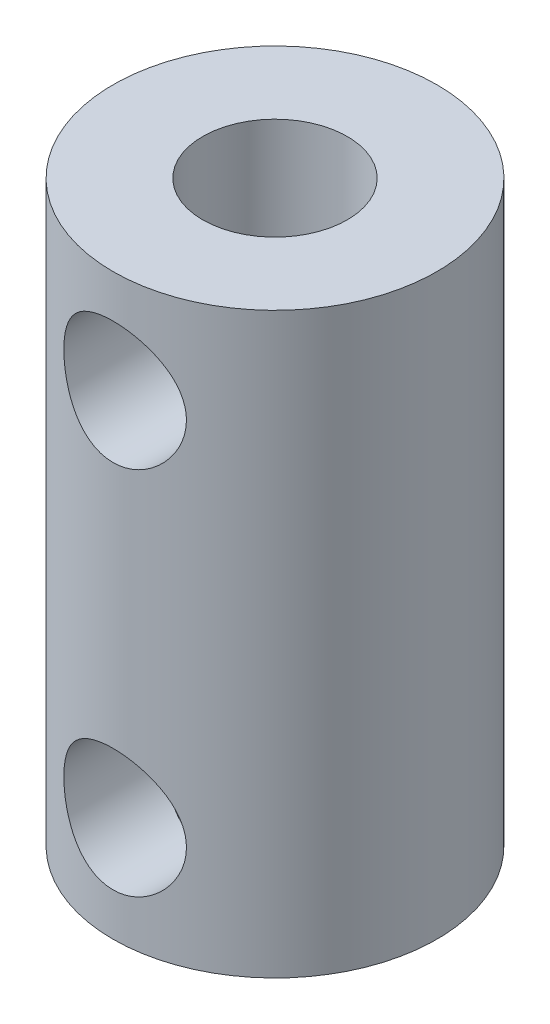
ISO-10303-21;
HEADER;
FILE_DESCRIPTION(('STEP AP214'),'2;1');
FILE_NAME('part.step','',(''),(''),'','','');
FILE_SCHEMA(('AUTOMOTIVE_DESIGN { 1 0 10303 214 1 1 1 1 }'));
ENDSEC;
DATA;
#1=APPLICATION_CONTEXT('core data for automotive mechanical design processes');
#2=APPLICATION_PROTOCOL_DEFINITION('international standard','automotive_design',2000,#1);
#3=PRODUCT_CONTEXT('',#1,'mechanical');
#4=PRODUCT('Part','Part','',(#3));
#5=PRODUCT_RELATED_PRODUCT_CATEGORY('part','',(#4));
#6=PRODUCT_DEFINITION_FORMATION('','',#4);
#7=PRODUCT_DEFINITION_CONTEXT('part definition',#1,'design');
#8=PRODUCT_DEFINITION('design','',#6,#7);
#9=PRODUCT_DEFINITION_SHAPE('','',#8);
#10=(LENGTH_UNIT() NAMED_UNIT(*) SI_UNIT(.MILLI.,.METRE.));
#11=(NAMED_UNIT(*) PLANE_ANGLE_UNIT() SI_UNIT($,.RADIAN.));
#12=(NAMED_UNIT(*) SI_UNIT($,.STERADIAN.) SOLID_ANGLE_UNIT());
#13=UNCERTAINTY_MEASURE_WITH_UNIT(LENGTH_MEASURE(1.E-05),#10,'distance_accuracy_value','');
#14=(GEOMETRIC_REPRESENTATION_CONTEXT(3) GLOBAL_UNCERTAINTY_ASSIGNED_CONTEXT((#13)) GLOBAL_UNIT_ASSIGNED_CONTEXT((#10,
#11,#12)) REPRESENTATION_CONTEXT('',''));
#15=CARTESIAN_POINT('',(0.,0.,0.));
#16=DIRECTION('',(0.,0.,1.));
#17=DIRECTION('',(1.,0.,0.));
#18=AXIS2_PLACEMENT_3D('',#15,#16,#17);
#19=CARTESIAN_POINT('',(0.,19.05,0.));
#20=DIRECTION('',(0.,-1.,0.));
#21=DIRECTION('',(0.,0.,-1.));
#22=AXIS2_PLACEMENT_3D('',#19,#20,#21);
#23=CYLINDRICAL_SURFACE('',#22,5.334);
#24=CARTESIAN_POINT('',(2.0193,15.621,4.93700146951568));
#25=CARTESIAN_POINT('',(2.01930447944565,15.5120335579433,4.93699724405045));
#26=CARTESIAN_POINT('',(2.01045059439057,15.4030962944664,4.94064814854933));
#27=CARTESIAN_POINT('',(1.97543444054489,15.1885111713563,4.95475201963925));
#28=CARTESIAN_POINT('',(1.94927294682313,15.0828631646455,4.96520468163384));
#29=CARTESIAN_POINT('',(1.88074304619809,14.8780172165251,4.99156194094386));
#30=CARTESIAN_POINT('',(1.83841414033232,14.7788042384707,5.00745324054417));
#31=CARTESIAN_POINT('',(1.73889128334472,14.5888489765568,5.04287560500619));
#32=CARTESIAN_POINT('',(1.68169277752621,14.4981092997438,5.06240778458365));
#33=CARTESIAN_POINT('',(1.55095007886271,14.3230779704603,5.1040199433203));
#34=CARTESIAN_POINT('',(1.47677408325426,14.2392761792463,5.12617585427608));
#35=CARTESIAN_POINT('',(1.31552180232293,14.0849552129414,5.16990629793248));
#36=CARTESIAN_POINT('',(1.22844270450761,14.0144389413296,5.19148070266726));
#37=CARTESIAN_POINT('',(1.04012523794396,13.8863181623324,5.23252204526852));
#38=CARTESIAN_POINT('',(0.938499803257831,13.8292478975599,5.25188961400418));
#39=CARTESIAN_POINT('',(0.726227423158128,13.7332177255443,5.28542063488425));
#40=CARTESIAN_POINT('',(0.615583687488664,13.694251407642,5.29958592879611));
#41=CARTESIAN_POINT('',(0.393566749542695,13.637258622755,5.32057718322423));
#42=CARTESIAN_POINT('',(0.282438553669897,13.6183884135688,5.32769789450094));
#43=CARTESIAN_POINT('',(0.0583798398278738,13.5994181530748,5.33485652895422));
#44=CARTESIAN_POINT('',(-0.0545500684528991,13.5993118814679,5.33489679931724));
#45=CARTESIAN_POINT('',(-0.272951762873949,13.6173851886313,5.32807636219454));
#46=CARTESIAN_POINT('',(-0.378512558081566,13.6346433362102,5.32156339727964));
#47=CARTESIAN_POINT('',(-0.585111251091155,13.6854031817999,5.30282614548131));
#48=CARTESIAN_POINT('',(-0.686148827388549,13.7189060324673,5.29060145331974));
#49=CARTESIAN_POINT('',(-0.882591199788241,13.8016228590768,5.26142589156488));
#50=CARTESIAN_POINT('',(-0.977891853376851,13.8510597051342,5.24440843901689));
#51=CARTESIAN_POINT('',(-1.15908281530853,13.964042392838,5.20736477295068));
#52=CARTESIAN_POINT('',(-1.24497004337342,14.027592832296,5.18733757963256));
#53=CARTESIAN_POINT('',(-1.41031734945089,14.1714187169088,5.14492730665769));
#54=CARTESIAN_POINT('',(-1.48909060289719,14.2524645063247,5.12247495361345));
#55=CARTESIAN_POINT('',(-1.6321897223364,14.426744223767,5.07869327063848));
#56=CARTESIAN_POINT('',(-1.69651181554814,14.5199813245657,5.05736423508365));
#57=CARTESIAN_POINT('',(-1.81023010786301,14.7187569660041,5.01780263958016));
#58=CARTESIAN_POINT('',(-1.85924901990288,14.8245291017029,4.99965257367589));
#59=CARTESIAN_POINT('',(-1.93851753880742,15.0436953907817,4.96945937974622));
#60=CARTESIAN_POINT('',(-1.96877783080307,15.1570851641898,4.95741277583277));
#61=CARTESIAN_POINT('',(-2.0080927254921,15.381470834286,4.94161372576153));
#62=CARTESIAN_POINT('',(-2.01824049485178,15.4922448827508,4.93743437273379));
#63=CARTESIAN_POINT('',(-2.02020093934924,15.7139676015321,4.93663342024542));
#64=CARTESIAN_POINT('',(-2.01201832383528,15.8249162196809,4.94000987958409));
#65=CARTESIAN_POINT('',(-1.97854205652087,16.0381681308523,4.95350589275915));
#66=CARTESIAN_POINT('',(-1.95410194104482,16.1406292160252,4.96328872527596));
#67=CARTESIAN_POINT('',(-1.88988298600506,16.3399465155951,4.98809328378994));
#68=CARTESIAN_POINT('',(-1.85010096750629,16.4368015636007,5.00311609548081));
#69=CARTESIAN_POINT('',(-1.75463072385413,16.626246264666,5.03740860205377));
#70=CARTESIAN_POINT('',(-1.69839621410486,16.7185346107973,5.05681781536739));
#71=CARTESIAN_POINT('',(-1.57219523321137,16.8927525289866,5.09746480725639));
#72=CARTESIAN_POINT('',(-1.50222365366067,16.9746782287931,5.11870326441882));
#73=CARTESIAN_POINT('',(-1.34516894631353,17.1313561978071,5.16227937258415));
#74=CARTESIAN_POINT('',(-1.25727058071109,17.2052991261111,5.18459902436317));
#75=CARTESIAN_POINT('',(-1.06976739053702,17.3374862714004,5.22650650196035));
#76=CARTESIAN_POINT('',(-0.970162473418259,17.3957303642651,5.24609430617898));
#77=CARTESIAN_POINT('',(-0.762084546055996,17.4945035084064,5.28032694944767));
#78=CARTESIAN_POINT('',(-0.653639678197282,17.5350863566806,5.29498676788628));
#79=CARTESIAN_POINT('',(-0.430779322695876,17.5971996745722,5.31775366325145));
#80=CARTESIAN_POINT('',(-0.316366729446476,17.6187392909675,5.32586388589443));
#81=CARTESIAN_POINT('',(-0.0921269840688149,17.6411543720754,5.33431446661301));
#82=CARTESIAN_POINT('',(0.0175700260696667,17.6431789284285,5.33508685186249));
#83=CARTESIAN_POINT('',(0.235675890355791,17.629473185899,5.32990684279753));
#84=CARTESIAN_POINT('',(0.344084903230242,17.6137450981927,5.32395528598201));
#85=CARTESIAN_POINT('',(0.553754325491232,17.5657898974954,5.3061959436016));
#86=CARTESIAN_POINT('',(0.65512610504446,17.5339892623025,5.29453976881732));
#87=CARTESIAN_POINT('',(0.851099804673822,17.455219495065,5.26659215506921));
#88=CARTESIAN_POINT('',(0.945700438435499,17.408247490209,5.2502998382871));
#89=CARTESIAN_POINT('',(1.12984126460487,17.2982057895377,5.21384686801513));
#90=CARTESIAN_POINT('',(1.21899691290268,17.234538077362,5.19355150342232));
#91=CARTESIAN_POINT('',(1.38571137675006,17.0938489191121,5.15157869080139));
#92=CARTESIAN_POINT('',(1.46326600313847,17.0168226708103,5.1299007475314));
#93=CARTESIAN_POINT('',(1.60889417238223,16.8466570416454,5.08616858438968));
#94=CARTESIAN_POINT('',(1.6762289849352,16.7528718973078,5.06415732477682));
#95=CARTESIAN_POINT('',(1.79422016325732,16.5546238470352,5.0235682226187));
#96=CARTESIAN_POINT('',(1.84487417660335,16.4501594377681,5.00499086450409));
#97=CARTESIAN_POINT('',(1.92989734602869,16.2276068736325,4.97285117373348));
#98=CARTESIAN_POINT('',(1.96328114135574,16.1090925540968,4.9596003647767));
#99=CARTESIAN_POINT('',(2.00797225124147,15.8673708442459,4.94168088836878));
#100=CARTESIAN_POINT('',(2.01929493679982,15.7441667825565,4.93700624563709));
#101=CARTESIAN_POINT('',(2.0193,15.621,4.93700146951568));
#102=B_SPLINE_CURVE_WITH_KNOTS('',3,(#24,#25,#26,#27,#28,#29,#30,#31,#32,#33,#34,#35,#36,#37,
#38,#39,#40,#41,#42,#43,#44,#45,#46,#47,#48,#49,#50,#51,#52,#53,#54,#55,#56,#57,#58,#59,#60,#61,
#62,#63,#64,#65,#66,#67,#68,#69,#70,#71,#72,#73,#74,#75,#76,#77,#78,#79,#80,#81,#82,#83,#84,#85,
#86,#87,#88,#89,#90,#91,#92,#93,#94,#95,#96,#97,#98,#99,#100,#101),.UNSPECIFIED.,.T.,.F.,(4,2,2,
2,2,2,2,2,2,2,2,2,2,2,2,2,2,2,2,2,2,2,2,2,2,2,2,2,2,2,2,2,2,2,2,2,2,2,4),(0.,0.326440462933106,
0.652866308208241,0.978499662966162,1.30423288001533,1.64497726295524,1.98579602758814,
2.33846601182069,2.6910110192498,3.02808777213958,3.3650527829088,3.68503301877185,
4.00503596242418,4.32972461584072,4.6545191992502,4.99864582720001,5.3428621925583,
5.69499486283585,6.04692676944591,6.37913973630185,6.71126736249903,7.02720512429606,
7.34320838551139,7.67120245546792,7.99931872846169,8.34870603281663,8.69809609946862,
9.04641432838323,9.39456516328482,9.72208120206037,10.0495564516543,10.3687657960399,
10.6880356205533,11.0208403418839,11.3537649513075,11.7046787209908,12.0556419573988,
12.4248810015917,12.7938626876671),.UNSPECIFIED.);
#103=CARTESIAN_POINT('',(2.0193,15.621,4.93700146951568));
#104=VERTEX_POINT('',#103);
#105=EDGE_CURVE('E107',#104,#104,#102,.T.);
#106=ORIENTED_EDGE('',*,*,#105,.T.);
#107=EDGE_LOOP('',(#106));
#108=FACE_BOUND('',#107,.T.);
#109=CARTESIAN_POINT('',(2.0193,3.429,4.93700146951568));
#110=CARTESIAN_POINT('',(2.01930447944565,3.32003355794329,4.93699724405045));
#111=CARTESIAN_POINT('',(2.01045059439057,3.21109629446639,4.94064814854933));
#112=CARTESIAN_POINT('',(1.97543444054489,2.99651117135628,4.95475201963925));
#113=CARTESIAN_POINT('',(1.94927294682313,2.89086316464548,4.96520468163384));
#114=CARTESIAN_POINT('',(1.88074304619809,2.68601721652511,4.99156194094386));
#115=CARTESIAN_POINT('',(1.83841414033232,2.5868042384707,5.00745324054417));
#116=CARTESIAN_POINT('',(1.73889128334472,2.39684897655679,5.04287560500619));
#117=CARTESIAN_POINT('',(1.68169277752621,2.30610929974384,5.06240778458365));
#118=CARTESIAN_POINT('',(1.55095007886271,2.1310779704603,5.1040199433203));
#119=CARTESIAN_POINT('',(1.47677408325426,2.04727617924628,5.12617585427608));
#120=CARTESIAN_POINT('',(1.31552180232293,1.89295521294143,5.16990629793248));
#121=CARTESIAN_POINT('',(1.22844270450761,1.8224389413296,5.19148070266726));
#122=CARTESIAN_POINT('',(1.04012523794396,1.69431816233236,5.23252204526852));
#123=CARTESIAN_POINT('',(0.938499803257831,1.63724789755994,5.25188961400418));
#124=CARTESIAN_POINT('',(0.726227423158128,1.54121772554432,5.28542063488425));
#125=CARTESIAN_POINT('',(0.615583687488665,1.50225140764203,5.29958592879611));
#126=CARTESIAN_POINT('',(0.393566749542695,1.44525862275502,5.32057718322423));
#127=CARTESIAN_POINT('',(0.282438553669898,1.42638841356883,5.32769789450094));
#128=CARTESIAN_POINT('',(0.0583798398278739,1.40741815307482,5.33485652895422));
#129=CARTESIAN_POINT('',(-0.0545500684528991,1.40731188146786,5.33489679931724));
#130=CARTESIAN_POINT('',(-0.272951762873949,1.42538518863126,5.32807636219454));
#131=CARTESIAN_POINT('',(-0.378512558081566,1.44264333621018,5.32156339727964));
#132=CARTESIAN_POINT('',(-0.585111251091156,1.49340318179991,5.30282614548131));
#133=CARTESIAN_POINT('',(-0.686148827388549,1.52690603246726,5.29060145331974));
#134=CARTESIAN_POINT('',(-0.882591199788242,1.60962285907683,5.26142589156488));
#135=CARTESIAN_POINT('',(-0.977891853376852,1.65905970513419,5.24440843901689));
#136=CARTESIAN_POINT('',(-1.15908281530853,1.77204239283796,5.20736477295068));
#137=CARTESIAN_POINT('',(-1.24497004337342,1.83559283229603,5.18733757963256));
#138=CARTESIAN_POINT('',(-1.41031734945089,1.97941871690877,5.14492730665769));
#139=CARTESIAN_POINT('',(-1.48909060289719,2.06046450632471,5.12247495361345));
#140=CARTESIAN_POINT('',(-1.6321897223364,2.23474422376699,5.07869327063848));
#141=CARTESIAN_POINT('',(-1.69651181554814,2.32798132456567,5.05736423508365));
#142=CARTESIAN_POINT('',(-1.81023010786301,2.52675696600407,5.01780263958016));
#143=CARTESIAN_POINT('',(-1.85924901990288,2.63252910170293,4.99965257367589));
#144=CARTESIAN_POINT('',(-1.93851753880742,2.85169539078174,4.96945937974622));
#145=CARTESIAN_POINT('',(-1.96877783080307,2.96508516418983,4.95741277583277));
#146=CARTESIAN_POINT('',(-2.0080927254921,3.18947083428604,4.94161372576153));
#147=CARTESIAN_POINT('',(-2.01824049485178,3.30024488275082,4.93743437273379));
#148=CARTESIAN_POINT('',(-2.02020093934924,3.52196760153214,4.93663342024542));
#149=CARTESIAN_POINT('',(-2.01201832383528,3.63291621968089,4.94000987958409));
#150=CARTESIAN_POINT('',(-1.97854205652087,3.84616813085234,4.95350589275915));
#151=CARTESIAN_POINT('',(-1.95410194104482,3.94862921602521,4.96328872527596));
#152=CARTESIAN_POINT('',(-1.88988298600506,4.14794651559512,4.98809328378994));
#153=CARTESIAN_POINT('',(-1.85010096750629,4.24480156360068,5.00311609548081));
#154=CARTESIAN_POINT('',(-1.75463072385413,4.43424626466602,5.03740860205377));
#155=CARTESIAN_POINT('',(-1.69839621410486,4.5265346107973,5.05681781536739));
#156=CARTESIAN_POINT('',(-1.57219523321137,4.70075252898663,5.09746480725639));
#157=CARTESIAN_POINT('',(-1.50222365366067,4.78267822879312,5.11870326441882));
#158=CARTESIAN_POINT('',(-1.34516894631353,4.93935619780713,5.16227937258415));
#159=CARTESIAN_POINT('',(-1.25727058071109,5.01329912611112,5.18459902436317));
#160=CARTESIAN_POINT('',(-1.06976739053702,5.14548627140036,5.22650650196035));
#161=CARTESIAN_POINT('',(-0.970162473418259,5.20373036426514,5.24609430617898));
#162=CARTESIAN_POINT('',(-0.762084546055996,5.30250350840644,5.28032694944767));
#163=CARTESIAN_POINT('',(-0.653639678197282,5.34308635668056,5.29498676788628));
#164=CARTESIAN_POINT('',(-0.430779322695876,5.40519967457225,5.31775366325145));
#165=CARTESIAN_POINT('',(-0.316366729446475,5.42673929096748,5.32586388589443));
#166=CARTESIAN_POINT('',(-0.0921269840688147,5.44915437207543,5.33431446661301));
#167=CARTESIAN_POINT('',(0.0175700260696662,5.45117892842854,5.33508685186249));
#168=CARTESIAN_POINT('',(0.23567589035579,5.43747318589899,5.32990684279753));
#169=CARTESIAN_POINT('',(0.344084903230243,5.42174509819271,5.32395528598201));
#170=CARTESIAN_POINT('',(0.553754325491234,5.37378989749537,5.3061959436016));
#171=CARTESIAN_POINT('',(0.655126105044462,5.3419892623025,5.29453976881732));
#172=CARTESIAN_POINT('',(0.851099804673824,5.263219495065,5.26659215506921));
#173=CARTESIAN_POINT('',(0.945700438435501,5.21624749020903,5.2502998382871));
#174=CARTESIAN_POINT('',(1.12984126460487,5.1062057895377,5.21384686801513));
#175=CARTESIAN_POINT('',(1.21899691290268,5.04253807736199,5.19355150342232));
#176=CARTESIAN_POINT('',(1.38571137675006,4.90184891911211,5.15157869080139));
#177=CARTESIAN_POINT('',(1.46326600313847,4.82482267081035,5.1299007475314));
#178=CARTESIAN_POINT('',(1.60889417238223,4.65465704164544,5.08616858438968));
#179=CARTESIAN_POINT('',(1.6762289849352,4.5608718973078,5.06415732477682));
#180=CARTESIAN_POINT('',(1.79422016325732,4.36262384703517,5.0235682226187));
#181=CARTESIAN_POINT('',(1.84487417660335,4.25815943776813,5.00499086450409));
#182=CARTESIAN_POINT('',(1.92989734602869,4.03560687363247,4.97285117373348));
#183=CARTESIAN_POINT('',(1.96328114135574,3.91709255409683,4.9596003647767));
#184=CARTESIAN_POINT('',(2.00797225124147,3.67537084424586,4.94168088836878));
#185=CARTESIAN_POINT('',(2.01929493679982,3.55216678255649,4.93700624563709));
#186=CARTESIAN_POINT('',(2.0193,3.429,4.93700146951568));
#187=B_SPLINE_CURVE_WITH_KNOTS('',3,(#109,#110,#111,#112,#113,#114,#115,#116,#117,#118,#119,
#120,#121,#122,#123,#124,#125,#126,#127,#128,#129,#130,#131,#132,#133,#134,#135,#136,#137,#138,
#139,#140,#141,#142,#143,#144,#145,#146,#147,#148,#149,#150,#151,#152,#153,#154,#155,#156,#157,
#158,#159,#160,#161,#162,#163,#164,#165,#166,#167,#168,#169,#170,#171,#172,#173,#174,#175,#176,
#177,#178,#179,#180,#181,#182,#183,#184,#185,#186),.UNSPECIFIED.,.T.,.F.,(4,2,2,2,2,2,2,2,2,2,2,
2,2,2,2,2,2,2,2,2,2,2,2,2,2,2,2,2,2,2,2,2,2,2,2,2,2,2,4),(0.,0.326440462933105,
0.652866308208241,0.978499662966163,1.30423288001533,1.64497726295524,1.98579602758814,
2.33846601182069,2.6910110192498,3.02808777213957,3.3650527829088,3.68503301877185,
4.00503596242418,4.32972461584072,4.6545191992502,4.99864582720001,5.34286219255831,
5.69499486283585,6.04692676944592,6.37913973630185,6.71126736249903,7.02720512429606,
7.3432083855114,7.67120245546792,7.99931872846169,8.34870603281663,8.69809609946862,
9.04641432838323,9.39456516328482,9.72208120206037,10.0495564516543,10.3687657960399,
10.6880356205533,11.0208403418839,11.3537649513075,11.7046787209908,12.0556419573988,
12.4248810015917,12.7938626876671),.UNSPECIFIED.);
#188=CARTESIAN_POINT('',(2.0193,3.429,4.93700146951568));
#189=VERTEX_POINT('',#188);
#190=EDGE_CURVE('E56',#189,#189,#187,.T.);
#191=ORIENTED_EDGE('',*,*,#190,.T.);
#192=EDGE_LOOP('',(#191));
#193=FACE_BOUND('',#192,.T.);
#194=CARTESIAN_POINT('',(0.,19.05,0.));
#195=DIRECTION('',(0.,1.,0.));
#196=DIRECTION('',(0.,0.,1.));
#197=AXIS2_PLACEMENT_3D('',#194,#195,#196);
#198=CIRCLE('',#197,5.334);
#199=CARTESIAN_POINT('',(0.,19.05,5.334));
#200=VERTEX_POINT('',#199);
#201=EDGE_CURVE('E10',#200,#200,#198,.T.);
#202=ORIENTED_EDGE('',*,*,#201,.F.);
#203=EDGE_LOOP('',(#202));
#204=FACE_BOUND('',#203,.T.);
#205=CARTESIAN_POINT('',(0.,0.,0.));
#206=DIRECTION('',(0.,1.,0.));
#207=DIRECTION('',(0.,0.,1.));
#208=AXIS2_PLACEMENT_3D('',#205,#206,#207);
#209=CIRCLE('',#208,5.334);
#210=CARTESIAN_POINT('',(0.,0.,5.334));
#211=VERTEX_POINT('',#210);
#212=EDGE_CURVE('E41',#211,#211,#209,.T.);
#213=ORIENTED_EDGE('',*,*,#212,.T.);
#214=EDGE_LOOP('',(#213));
#215=FACE_BOUND('',#214,.T.);
#216=ADVANCED_FACE('F33',(#108,#193,#204,#215),#23,.T.);
#217=CARTESIAN_POINT('',(0.,19.05,0.));
#218=DIRECTION('',(0.,1.,0.));
#219=DIRECTION('',(0.,0.,1.));
#220=AXIS2_PLACEMENT_3D('',#217,#218,#219);
#221=PLANE('',#220);
#222=CARTESIAN_POINT('',(0.,19.05,0.));
#223=DIRECTION('',(0.,1.,0.));
#224=DIRECTION('',(0.,0.,1.));
#225=AXIS2_PLACEMENT_3D('',#222,#223,#224);
#226=CIRCLE('',#225,2.38125);
#227=CARTESIAN_POINT('',(0.,19.05,2.38125));
#228=VERTEX_POINT('',#227);
#229=EDGE_CURVE('E46',#228,#228,#226,.T.);
#230=ORIENTED_EDGE('',*,*,#229,.F.);
#231=EDGE_LOOP('',(#230));
#232=FACE_BOUND('',#231,.T.);
#233=ORIENTED_EDGE('',*,*,#201,.T.);
#234=EDGE_LOOP('',(#233));
#235=FACE_BOUND('',#234,.T.);
#236=ADVANCED_FACE('F91',(#232,#235),#221,.T.);
#237=CARTESIAN_POINT('',(0.,0.,0.));
#238=DIRECTION('',(0.,1.,0.));
#239=DIRECTION('',(0.,0.,1.));
#240=AXIS2_PLACEMENT_3D('',#237,#238,#239);
#241=PLANE('',#240);
#242=CARTESIAN_POINT('',(0.,0.,0.));
#243=DIRECTION('',(0.,-1.,0.));
#244=DIRECTION('',(0.,0.,-1.));
#245=AXIS2_PLACEMENT_3D('',#242,#243,#244);
#246=CIRCLE('',#245,2.5);
#247=CARTESIAN_POINT('',(0.,0.,-2.5));
#248=VERTEX_POINT('',#247);
#249=EDGE_CURVE('E53',#248,#248,#246,.T.);
#250=ORIENTED_EDGE('',*,*,#249,.F.);
#251=EDGE_LOOP('',(#250));
#252=FACE_BOUND('',#251,.T.);
#253=ORIENTED_EDGE('',*,*,#212,.F.);
#254=EDGE_LOOP('',(#253));
#255=FACE_BOUND('',#254,.T.);
#256=ADVANCED_FACE('F89',(#252,#255),#241,.F.);
#257=CARTESIAN_POINT('',(0.,19.05,0.));
#258=DIRECTION('',(0.,1.,0.));
#259=DIRECTION('',(0.,0.,1.));
#260=AXIS2_PLACEMENT_3D('',#257,#258,#259);
#261=CYLINDRICAL_SURFACE('',#260,2.38125);
#262=CARTESIAN_POINT('',(0.,13.6017,2.38125));
#263=CARTESIAN_POINT('',(0.0953629104655444,13.6017076270073,2.38124253039144));
#264=CARTESIAN_POINT('',(0.190802108760295,13.6085092245672,2.37546734710483));
#265=CARTESIAN_POINT('',(0.378522642630376,13.6352212283207,2.35288074385142));
#266=CARTESIAN_POINT('',(0.470799602849391,13.6551490824309,2.33605463466276));
#267=CARTESIAN_POINT('',(0.649001001306386,13.7066013327425,2.29292507231236));
#268=CARTESIAN_POINT('',(0.734961456500048,13.7380526583004,2.26668135756056));
#269=CARTESIAN_POINT('',(0.899589961526483,13.8109090763623,2.20653313778075));
#270=CARTESIAN_POINT('',(0.978256219196272,13.8523166061443,2.17262675705496));
#271=CARTESIAN_POINT('',(1.15557339189203,13.9606690983626,2.08520638110215));
#272=CARTESIAN_POINT('',(1.25065737001747,14.0313678422185,2.02910742735934));
#273=CARTESIAN_POINT('',(1.42522939866516,14.1857486420274,1.9105672437686));
#274=CARTESIAN_POINT('',(1.50467346358863,14.2694661624849,1.84810885556737));
#275=CARTESIAN_POINT('',(1.64933174400918,14.4501248906923,1.72031634910399));
#276=CARTESIAN_POINT('',(1.7142350405087,14.5472939776329,1.65494982419495));
#277=CARTESIAN_POINT('',(1.79900279926647,14.701981110901,1.56068668781034));
#278=CARTESIAN_POINT('',(1.82514764292368,14.7549941912649,1.52991595681427));
#279=CARTESIAN_POINT('',(1.87308341201357,14.8642374873892,1.47083283951932));
#280=CARTESIAN_POINT('',(1.8948779467709,14.9204649859904,1.44251842640646));
#281=CARTESIAN_POINT('',(1.93515484360135,15.0404584935458,1.38807520873408));
#282=CARTESIAN_POINT('',(1.95329720946325,15.1044766102372,1.3622394432428));
#283=CARTESIAN_POINT('',(1.98347250317504,15.236338473294,1.31791921961998));
#284=CARTESIAN_POINT('',(1.99551907391841,15.3041732957463,1.29941836563926));
#285=CARTESIAN_POINT('',(2.01275183491318,15.4438078770719,1.27257913004167));
#286=CARTESIAN_POINT('',(2.01784043973761,15.5156496128869,1.26438543090715));
#287=CARTESIAN_POINT('',(2.0202109452522,15.659784754737,1.26059917402889));
#288=CARTESIAN_POINT('',(2.0174974139974,15.7320778717616,1.26499924278155));
#289=CARTESIAN_POINT('',(2.00556583448943,15.8639689210915,1.28380009597221));
#290=CARTESIAN_POINT('',(1.99734029349534,15.9238963480108,1.29667017310109));
#291=CARTESIAN_POINT('',(1.97601922564263,16.0410864318142,1.32893840545107));
#292=CARTESIAN_POINT('',(1.96291624825171,16.0983448603164,1.34834654356129));
#293=CARTESIAN_POINT('',(1.91962562556337,16.2565468704425,1.40986433156581));
#294=CARTESIAN_POINT('',(1.88431652143136,16.3539536213483,1.45738069102626));
#295=CARTESIAN_POINT('',(1.80116917724329,16.5395563826945,1.55900816204377));
#296=CARTESIAN_POINT('',(1.75329242865502,16.6277228977561,1.61313926455451));
#297=CARTESIAN_POINT('',(1.64169366565831,16.8016064267268,1.72684696177914));
#298=CARTESIAN_POINT('',(1.57707096504213,16.8866763138118,1.78653285717384));
#299=CARTESIAN_POINT('',(1.43420776393953,17.0465112361713,1.90312927518302));
#300=CARTESIAN_POINT('',(1.35598534079128,17.1212897177608,1.96004335525068));
#301=CARTESIAN_POINT('',(1.1937973566035,17.25264332855,2.06240638801489));
#302=CARTESIAN_POINT('',(1.11105271771877,17.3102667594781,2.10842977698979));
#303=CARTESIAN_POINT('',(0.934740743635291,17.4138330572115,2.19228358488733));
#304=CARTESIAN_POINT('',(0.8411841837081,17.4597874099309,2.2301220547756));
#305=CARTESIAN_POINT('',(0.660869236672729,17.53113592417,2.28933903295416));
#306=CARTESIAN_POINT('',(0.575515659125593,17.5586667512911,2.31239984879339));
#307=CARTESIAN_POINT('',(0.399993716392279,17.6023473391943,2.34912219165516));
#308=CARTESIAN_POINT('',(0.309828677346097,17.6185048553954,2.36279012349982));
#309=CARTESIAN_POINT('',(0.126797439319749,17.6384232485674,2.37965270338348));
#310=CARTESIAN_POINT('',(0.033922319232656,17.6421370413493,2.38280757216265));
#311=CARTESIAN_POINT('',(-0.151185636568344,17.636760192234,2.37824856745242));
#312=CARTESIAN_POINT('',(-0.243418448211273,17.6276690730308,2.37053428881312));
#313=CARTESIAN_POINT('',(-0.41896997054738,17.5982435436763,2.34567983478572));
#314=CARTESIAN_POINT('',(-0.502492913962305,17.5786080587715,2.32912593466773));
#315=CARTESIAN_POINT('',(-0.664593343101055,17.5296821055859,2.28815854063724));
#316=CARTESIAN_POINT('',(-0.743169376824571,17.5003888181695,2.26374275186925));
#317=CARTESIAN_POINT('',(-0.919852589971678,17.4220230109408,2.19904801878522));
#318=CARTESIAN_POINT('',(-1.01553997074513,17.36961177439,2.15619757544733));
#319=CARTESIAN_POINT('',(-1.19468913365272,17.2525032364045,2.06236779965669));
#320=CARTESIAN_POINT('',(-1.27812179553657,17.1877774835785,2.01136968748996));
#321=CARTESIAN_POINT('',(-1.45119087781151,17.0310985533581,1.89154679433479));
#322=CARTESIAN_POINT('',(-1.53740332960101,16.9363517031615,1.82140250704937));
#323=CARTESIAN_POINT('',(-1.65207424503778,16.7838685965978,1.715728840076));
#324=CARTESIAN_POINT('',(-1.687869347945,16.7312878561271,1.68041214277636));
#325=CARTESIAN_POINT('',(-1.75456066562764,16.6225751997354,1.6106487602069));
#326=CARTESIAN_POINT('',(-1.78545952199067,16.5664452217005,1.57620161429492));
#327=CARTESIAN_POINT('',(-1.84796877922345,16.4386950799512,1.50270744478183));
#328=CARTESIAN_POINT('',(-1.87845687219802,16.3662394344464,1.46414097880304));
#329=CARTESIAN_POINT('',(-1.93144724503865,16.2155070598855,1.39348686457468));
#330=CARTESIAN_POINT('',(-1.9539674166441,16.1372438561786,1.3613847715625));
#331=CARTESIAN_POINT('',(-1.98538624222466,15.9948155276654,1.31498466513879));
#332=CARTESIAN_POINT('',(-1.9962720951518,15.931910191203,1.2982502230309));
#333=CARTESIAN_POINT('',(-2.01204940552079,15.803697740078,1.27366831301809));
#334=CARTESIAN_POINT('',(-2.01695424974193,15.738396327331,1.2658010015761));
#335=CARTESIAN_POINT('',(-2.02032606665987,15.6068395958082,1.26041631836226));
#336=CARTESIAN_POINT('',(-2.01876027809157,15.5405811195119,1.26295161526086));
#337=CARTESIAN_POINT('',(-2.00928525318852,15.4096326228975,1.27796463966208));
#338=CARTESIAN_POINT('',(-2.0013649365759,15.3449455457608,1.29045973363885));
#339=CARTESIAN_POINT('',(-1.97610633653518,15.1966871933678,1.32892311049461));
#340=CARTESIAN_POINT('',(-1.95645139710514,15.1143672960938,1.35806488221722));
#341=CARTESIAN_POINT('',(-1.90841335172706,14.955834624832,1.42478018928226));
#342=CARTESIAN_POINT('',(-1.87999813217663,14.8796456433951,1.46238460788189));
#343=CARTESIAN_POINT('',(-1.82196684167892,14.7480379327118,1.53377378928459));
#344=CARTESIAN_POINT('',(-1.7937734967076,14.6915489100641,1.56677711567444));
#345=CARTESIAN_POINT('',(-1.73264267986451,14.58203067888,1.63412825855086));
#346=CARTESIAN_POINT('',(-1.69970257400005,14.5290034151808,1.66847681375158));
#347=CARTESIAN_POINT('',(-1.5939163758231,14.3749942620119,1.77185292190764));
#348=CARTESIAN_POINT('',(-1.51404351299942,14.2789486959278,1.84129071279044));
#349=CARTESIAN_POINT('',(-1.34939509735397,14.1150012083573,1.96428402065763));
#350=CARTESIAN_POINT('',(-1.26725299173133,14.0450422370068,2.01864155922671));
#351=CARTESIAN_POINT('',(-1.08972264759638,13.917482811403,2.11972433290263));
#352=CARTESIAN_POINT('',(-0.994357397765878,13.8598613412149,2.16646251402494));
#353=CARTESIAN_POINT('',(-0.812041029646358,13.769973498729,2.24021597200713));
#354=CARTESIAN_POINT('',(-0.727300939307045,13.7349352722986,2.26930869192804));
#355=CARTESIAN_POINT('',(-0.551486654471367,13.6762694578683,2.31829511643106));
#356=CARTESIAN_POINT('',(-0.460424306314068,13.6526211547451,2.33820551828878));
#357=CARTESIAN_POINT('',(-0.307294164921361,13.6242801971457,2.36212532556152));
#358=CARTESIAN_POINT('',(-0.246379535624374,13.6158404011036,2.36926887941074));
#359=CARTESIAN_POINT('',(-0.123654066976016,13.6045473483756,2.37883404529308));
#360=CARTESIAN_POINT('',(-0.0618430751152341,13.6016950538676,2.38125484405898));
#361=CARTESIAN_POINT('',(0.,13.6017,2.38125));
#362=B_SPLINE_CURVE_WITH_KNOTS('',3,(#262,#263,#264,#265,#266,#267,#268,#269,#270,#271,#272,
#273,#274,#275,#276,#277,#278,#279,#280,#281,#282,#283,#284,#285,#286,#287,#288,#289,#290,#291,
#292,#293,#294,#295,#296,#297,#298,#299,#300,#301,#302,#303,#304,#305,#306,#307,#308,#309,#310,
#311,#312,#313,#314,#315,#316,#317,#318,#319,#320,#321,#322,#323,#324,#325,#326,#327,#328,#329,
#330,#331,#332,#333,#334,#335,#336,#337,#338,#339,#340,#341,#342,#343,#344,#345,#346,#347,#348,
#349,#350,#351,#352,#353,#354,#355,#356,#357,#358,#359,#360,#361),.UNSPECIFIED.,.T.,.F.,(4,2,2,
2,2,2,2,2,2,2,2,2,2,2,2,2,2,2,2,2,2,2,2,2,2,2,2,2,2,2,2,2,2,2,2,2,2,2,2,2,2,2,2,2,2,2,2,2,2,4),
(0.,0.285822879040195,0.57202645343594,0.856445753836913,1.14093475107762,1.53209794078496,
1.92434599439993,2.32431590060554,2.52403541446242,2.7235885317362,2.93715270007047,
3.15023675633726,3.36627967860936,3.5821961361602,3.76703280299999,3.95215298372386,
4.2921755351078,4.6332523644257,4.99919381006235,5.36465249846071,5.69593902731847,
6.02689819451858,6.30353280425833,6.57997859465333,6.85746921825045,7.13497018564595,
7.39601018234615,7.6571264448098,8.00684479130714,8.35738115873557,8.79314751787049,
9.01122632070509,9.22918706367924,9.49127284105056,9.75276632050315,9.950020998349,
10.1468333627617,10.3446434195765,10.5427991458587,10.8098312197475,11.0778540646831,
11.291300372431,11.5048655815911,11.9314938535908,12.2926506380308,12.6531872386008,
12.9406636625171,13.2276152532279,13.4129401622071,13.5982969816649),.UNSPECIFIED.);
#363=CARTESIAN_POINT('',(0.,13.6017,2.38125));
#364=VERTEX_POINT('',#363);
#365=EDGE_CURVE('E114',#364,#364,#362,.T.);
#366=ORIENTED_EDGE('',*,*,#365,.T.);
#367=EDGE_LOOP('',(#366));
#368=FACE_BOUND('',#367,.T.);
#369=CARTESIAN_POINT('',(0.,9.59635219850952,0.));
#370=DIRECTION('',(0.,-1.,0.));
#371=DIRECTION('',(0.,0.,-1.));
#372=AXIS2_PLACEMENT_3D('',#369,#370,#371);
#373=CIRCLE('',#372,2.38125);
#374=CARTESIAN_POINT('',(0.,9.59635219850952,-2.38125));
#375=VERTEX_POINT('',#374);
#376=EDGE_CURVE('E37',#375,#375,#373,.T.);
#377=ORIENTED_EDGE('',*,*,#376,.T.);
#378=EDGE_LOOP('',(#377));
#379=FACE_BOUND('',#378,.T.);
#380=ORIENTED_EDGE('',*,*,#229,.T.);
#381=EDGE_LOOP('',(#380));
#382=FACE_BOUND('',#381,.T.);
#383=ADVANCED_FACE('F85',(#368,#379,#382),#261,.F.);
#384=CARTESIAN_POINT('',(0.,9.525,0.));
#385=DIRECTION('',(0.,-1.,0.));
#386=DIRECTION('',(0.,0.,-1.));
#387=AXIS2_PLACEMENT_3D('',#384,#385,#386);
#388=CONICAL_SURFACE('',#387,2.5,1.02974425867665);
#389=CARTESIAN_POINT('',(0.,9.525,0.));
#390=DIRECTION('',(0.,-1.,0.));
#391=DIRECTION('',(0.,0.,-1.));
#392=AXIS2_PLACEMENT_3D('',#389,#390,#391);
#393=CIRCLE('',#392,2.5);
#394=CARTESIAN_POINT('',(0.,9.525,-2.5));
#395=VERTEX_POINT('',#394);
#396=EDGE_CURVE('E50',#395,#395,#393,.T.);
#397=ORIENTED_EDGE('',*,*,#396,.T.);
#398=EDGE_LOOP('',(#397));
#399=FACE_BOUND('',#398,.T.);
#400=ORIENTED_EDGE('',*,*,#376,.F.);
#401=EDGE_LOOP('',(#400));
#402=FACE_BOUND('',#401,.T.);
#403=ADVANCED_FACE('F81',(#399,#402),#388,.F.);
#404=CARTESIAN_POINT('',(0.,0.,0.));
#405=DIRECTION('',(0.,-1.,0.));
#406=DIRECTION('',(0.,0.,-1.));
#407=AXIS2_PLACEMENT_3D('',#404,#405,#406);
#408=CYLINDRICAL_SURFACE('',#407,2.5);
#409=CARTESIAN_POINT('',(2.0193,3.429,1.47391570654498));
#410=CARTESIAN_POINT('',(2.01929480722155,3.50381715267296,1.47392817298034));
#411=CARTESIAN_POINT('',(2.01509305438288,3.57875873832696,1.47973177177314));
#412=CARTESIAN_POINT('',(1.9986920577392,3.72625278761965,1.50179953959199));
#413=CARTESIAN_POINT('',(1.98646694346138,3.7987967228186,1.51809754348623));
#414=CARTESIAN_POINT('',(1.9492780717501,3.96522371098289,1.56572883433401));
#415=CARTESIAN_POINT('',(1.92132304975767,4.05746663510951,1.600353948373));
#416=CARTESIAN_POINT('',(1.85422314092622,4.23424923392652,1.67764101224753));
#417=CARTESIAN_POINT('',(1.8150448995115,4.31876494128158,1.72032678694467));
#418=CARTESIAN_POINT('',(1.74026753050542,4.45518708790099,1.7953695088374));
#419=CARTESIAN_POINT('',(1.70732483369806,4.50907955485488,1.82682556730136));
#420=CARTESIAN_POINT('',(1.63673711570054,4.61332757344562,1.89033056125068));
#421=CARTESIAN_POINT('',(1.59909033781285,4.66368179272193,1.92237971439294));
#422=CARTESIAN_POINT('',(1.47926544436131,4.80926629513213,2.01796161408399));
#423=CARTESIAN_POINT('',(1.39008353685324,4.89923509773919,2.08105533247435));
#424=CARTESIAN_POINT('',(1.21332923854671,5.04635233234182,2.18775655279472));
#425=CARTESIAN_POINT('',(1.12903037750067,5.10646341281088,2.23273276258078));
#426=CARTESIAN_POINT('',(0.949376709043434,5.21426875432219,2.31481868022345));
#427=CARTESIAN_POINT('',(0.854039558710234,5.26198246037785,2.35194069002827));
#428=CARTESIAN_POINT('',(0.670326271498947,5.335925581788,2.41005502549928));
#429=CARTESIAN_POINT('',(0.583378644426086,5.36439653148857,2.43269514678687));
#430=CARTESIAN_POINT('',(0.404602004181715,5.40949215662577,2.46872242982194));
#431=CARTESIAN_POINT('',(0.312775724850334,5.42612339296403,2.48211471607453));
#432=CARTESIAN_POINT('',(0.126426992802878,5.44652366712288,2.4985580350246));
#433=CARTESIAN_POINT('',(0.0318960123591653,5.45024611164752,2.50157160627638));
#434=CARTESIAN_POINT('',(-0.156486173102194,5.44443163768024,2.49687588189192));
#435=CARTESIAN_POINT('',(-0.250337360108218,5.43489436914501,2.48916630317512));
#436=CARTESIAN_POINT('',(-0.429140532047271,5.40413902413073,2.46445221174763));
#437=CARTESIAN_POINT('',(-0.514294277979378,5.3836217271112,2.44800573548021));
#438=CARTESIAN_POINT('',(-0.679541017418272,5.33249274127963,2.4073786253581));
#439=CARTESIAN_POINT('',(-0.759632705918594,5.30187846199631,2.38319600677465));
#440=CARTESIAN_POINT('',(-0.920770446303672,5.22853210750793,2.32597640251122));
#441=CARTESIAN_POINT('',(-1.00119655018713,5.18493058072048,2.29232018371873));
#442=CARTESIAN_POINT('',(-1.15369505620199,5.08872925839196,2.21949122380962));
#443=CARTESIAN_POINT('',(-1.22576310006027,5.03612480339223,2.18031562800905));
#444=CARTESIAN_POINT('',(-1.37523874956472,4.91144071608343,2.08993667695684));
#445=CARTESIAN_POINT('',(-1.45066899230468,4.83758326570845,2.03792128952945));
#446=CARTESIAN_POINT('',(-1.58880440740247,4.67971954922421,1.93216705282209));
#447=CARTESIAN_POINT('',(-1.65149250594816,4.59569990348643,1.87842600138097));
#448=CARTESIAN_POINT('',(-1.75958628758068,4.42444953244852,1.77733312807006));
#449=CARTESIAN_POINT('',(-1.80592689536945,4.33791516362523,1.7298026540642));
#450=CARTESIAN_POINT('',(-1.8864585351309,4.15611048656601,1.64159022044206));
#451=CARTESIAN_POINT('',(-1.92067607919658,4.06085982180561,1.60089342007613));
#452=CARTESIAN_POINT('',(-1.96632640337569,3.89377909236258,1.54416456673682));
#453=CARTESIAN_POINT('',(-1.98154800109557,3.82428030846641,1.5244099398553));
#454=CARTESIAN_POINT('',(-2.00464734514039,3.68220771768533,1.49390856928428));
#455=CARTESIAN_POINT('',(-2.01254234645966,3.60964155881149,1.48314066686151));
#456=CARTESIAN_POINT('',(-2.02036345833571,3.46274317897861,1.47247617440032));
#457=CARTESIAN_POINT('',(-2.02023580156782,3.38840238080046,1.47265293465194));
#458=CARTESIAN_POINT('',(-2.0118893933781,3.24100099223961,1.48402871659746));
#459=CARTESIAN_POINT('',(-2.00365994622033,3.16794222413041,1.49524230877438));
#460=CARTESIAN_POINT('',(-1.97703934818402,3.00843186439119,1.53032338883685));
#461=CARTESIAN_POINT('',(-1.95672334209333,2.92283895453988,1.55653509298971));
#462=CARTESIAN_POINT('',(-1.90644977534375,2.75779803691906,1.61771969357754));
#463=CARTESIAN_POINT('',(-1.87646281040627,2.67836969802777,1.6527192363802));
#464=CARTESIAN_POINT('',(-1.79115590372933,2.48831218330821,1.74568689316356));
#465=CARTESIAN_POINT('',(-1.73061991204157,2.38143344845843,1.80651395789612));
#466=CARTESIAN_POINT('',(-1.59198575897706,2.18079184755219,1.92983341880174));
#467=CARTESIAN_POINT('',(-1.51386486189693,2.0870462182822,1.99232787773042));
#468=CARTESIAN_POINT('',(-1.33868834736265,1.91206675899298,2.11412370307238));
#469=CARTESIAN_POINT('',(-1.24130762020885,1.83109803137646,2.1733440743849));
#470=CARTESIAN_POINT('',(-1.02924522725083,1.68700969583631,2.28138266596991));
#471=CARTESIAN_POINT('',(-0.914620369699288,1.62383336671874,2.3302338171976));
#472=CARTESIAN_POINT('',(-0.709566917792913,1.53631700123234,2.39879190838068));
#473=CARTESIAN_POINT('',(-0.62311237775013,1.5060179447815,2.42282352422951));
#474=CARTESIAN_POINT('',(-0.444963359276107,1.45717728277525,2.46176594276952));
#475=CARTESIAN_POINT('',(-0.35327297495911,1.4386266242872,2.47668376793678));
#476=CARTESIAN_POINT('',(-0.166706055375682,1.41438749665074,2.49620492264457));
#477=CARTESIAN_POINT('',(-0.0718178514248966,1.40875286089928,2.50076508118314));
#478=CARTESIAN_POINT('',(0.117708056155656,1.41090787039757,2.49902432329807));
#479=CARTESIAN_POINT('',(0.212345760997399,1.41869745057833,2.49272345951928));
#480=CARTESIAN_POINT('',(0.392478798314715,1.44624478116813,2.47056373925411));
#481=CARTESIAN_POINT('',(0.478175060631214,1.46522032677387,2.45532988066348));
#482=CARTESIAN_POINT('',(0.644740829759762,1.51343051818751,2.41694473259868));
#483=CARTESIAN_POINT('',(0.725609068995007,1.54266784444296,2.39379137453718));
#484=CARTESIAN_POINT('',(0.88767111137344,1.61294540711092,2.33879505673711));
#485=CARTESIAN_POINT('',(0.9683317314359,1.6547655117114,2.30638921826432));
#486=CARTESIAN_POINT('',(1.12154463098482,1.74741233435522,2.23590280226766));
#487=CARTESIAN_POINT('',(1.19409338451912,1.7982429443311,2.19781977371435));
#488=CARTESIAN_POINT('',(1.34451441899106,1.9187261746447,2.10981567153515));
#489=CARTESIAN_POINT('',(1.4205080296521,1.99010719271757,2.05905632923989));
#490=CARTESIAN_POINT('',(1.5601644816525,2.14284576316896,1.9553665919813));
#491=CARTESIAN_POINT('',(1.62380894191176,2.22421789730909,1.90243310066323));
#492=CARTESIAN_POINT('',(1.73723779994472,2.39466204154225,1.79937292606238));
#493=CARTESIAN_POINT('',(1.78728237313722,2.48353926115191,1.74921079366599));
#494=CARTESIAN_POINT('',(1.87436590683737,2.67075244151869,1.65554058689661));
#495=CARTESIAN_POINT('',(1.91142967284722,2.76906989916315,1.61201991196285));
#496=CARTESIAN_POINT('',(1.96080868074274,2.94118733851337,1.55120482828876));
#497=CARTESIAN_POINT('',(1.97725454143049,3.01239117295561,1.5299939339585));
#498=CARTESIAN_POINT('',(2.00240730513945,3.15816290411269,1.49693379349097));
#499=CARTESIAN_POINT('',(2.01114425218012,3.23271654016128,1.48504822393771));
#500=CARTESIAN_POINT('',(2.01687486699649,3.32801112533673,1.47723289234641));
#501=CARTESIAN_POINT('',(2.01778274194707,3.34817387682741,1.47599261432343));
#502=CARTESIAN_POINT('',(2.01899607356419,3.38855471339128,1.47433225023714));
#503=CARTESIAN_POINT('',(2.01930140389358,3.40877280917896,1.47391233618194));
#504=CARTESIAN_POINT('',(2.0193,3.429,1.47391570654498));
#505=B_SPLINE_CURVE_WITH_KNOTS('',3,(#409,#410,#411,#412,#413,#414,#415,#416,#417,#418,#419,
#420,#421,#422,#423,#424,#425,#426,#427,#428,#429,#430,#431,#432,#433,#434,#435,#436,#437,#438,
#439,#440,#441,#442,#443,#444,#445,#446,#447,#448,#449,#450,#451,#452,#453,#454,#455,#456,#457,
#458,#459,#460,#461,#462,#463,#464,#465,#466,#467,#468,#469,#470,#471,#472,#473,#474,#475,#476,
#477,#478,#479,#480,#481,#482,#483,#484,#485,#486,#487,#488,#489,#490,#491,#492,#493,#494,#495,
#496,#497,#498,#499,#500,#501,#502,#503,#504),.UNSPECIFIED.,.T.,.F.,(4,2,2,2,2,2,2,2,2,2,2,2,2,
2,2,2,2,2,2,2,2,2,2,2,2,2,2,2,2,2,2,2,2,2,2,2,2,2,2,2,2,2,2,2,2,2,2,4),(0.,0.224362322740661,
0.449451655704624,0.754990478545878,1.06144693177859,1.27288816827713,1.48440860295582,
1.90662570812593,2.24405113823281,2.58094408468373,2.86250451322326,3.1439087951397,
3.42632773306913,3.70875412672088,3.97499404894987,4.24130233062073,4.5326807236232,
4.8242103778679,5.1760224666996,5.52830290218207,5.85454510821448,6.18006938162419,
6.40080279480852,6.6210150257086,6.84270326080863,7.06468455492952,7.33852607700985,
7.61320818271304,8.02229646515856,8.43191673133524,8.84915467219725,9.26504702290817,
9.54802932993573,9.8307933138502,10.1147337188709,10.3986727475979,10.6647829745166,
10.9309627630469,11.2192984509036,11.5077589852118,11.8544132462528,12.2015795916085,
12.5415427910608,12.8808527514879,13.1083575134695,13.3349716520162,13.3956164121123,
13.4562738864078),.UNSPECIFIED.);
#506=CARTESIAN_POINT('',(2.0193,3.429,1.47391570654498));
#507=VERTEX_POINT('',#506);
#508=EDGE_CURVE('E62',#507,#507,#505,.T.);
#509=ORIENTED_EDGE('',*,*,#508,.T.);
#510=EDGE_LOOP('',(#509));
#511=FACE_BOUND('',#510,.T.);
#512=ORIENTED_EDGE('',*,*,#396,.F.);
#513=EDGE_LOOP('',(#512));
#514=FACE_BOUND('',#513,.T.);
#515=ORIENTED_EDGE('',*,*,#249,.T.);
#516=EDGE_LOOP('',(#515));
#517=FACE_BOUND('',#516,.T.);
#518=ADVANCED_FACE('F72',(#511,#514,#517),#408,.F.);
#519=CARTESIAN_POINT('',(0.,3.429,9.68166837848208));
#520=DIRECTION('',(0.,0.,1.));
#521=DIRECTION('',(1.,0.,0.));
#522=AXIS2_PLACEMENT_3D('',#519,#520,#521);
#523=CYLINDRICAL_SURFACE('',#522,2.0193);
#524=ORIENTED_EDGE('',*,*,#508,.F.);
#525=EDGE_LOOP('',(#524));
#526=FACE_BOUND('',#525,.T.);
#527=ORIENTED_EDGE('',*,*,#190,.F.);
#528=EDGE_LOOP('',(#527));
#529=FACE_BOUND('',#528,.T.);
#530=ADVANCED_FACE('F67',(#526,#529),#523,.F.);
#531=CARTESIAN_POINT('',(0.,15.621,9.68166837848208));
#532=DIRECTION('',(0.,0.,1.));
#533=DIRECTION('',(1.,0.,0.));
#534=AXIS2_PLACEMENT_3D('',#531,#532,#533);
#535=CYLINDRICAL_SURFACE('',#534,2.0193);
#536=ORIENTED_EDGE('',*,*,#365,.F.);
#537=EDGE_LOOP('',(#536));
#538=FACE_BOUND('',#537,.T.);
#539=ORIENTED_EDGE('',*,*,#105,.F.);
#540=EDGE_LOOP('',(#539));
#541=FACE_BOUND('',#540,.T.);
#542=ADVANCED_FACE('F71',(#538,#541),#535,.F.);
#543=CLOSED_SHELL('',(#216,#236,#256,#383,#403,#518,#530,#542));
#544=MANIFOLD_SOLID_BREP('B2',#543);
#545=ADVANCED_BREP_SHAPE_REPRESENTATION('',(#18,#544),#14);
#546=SHAPE_DEFINITION_REPRESENTATION(#9,#545);
ENDSEC;
END-ISO-10303-21;
